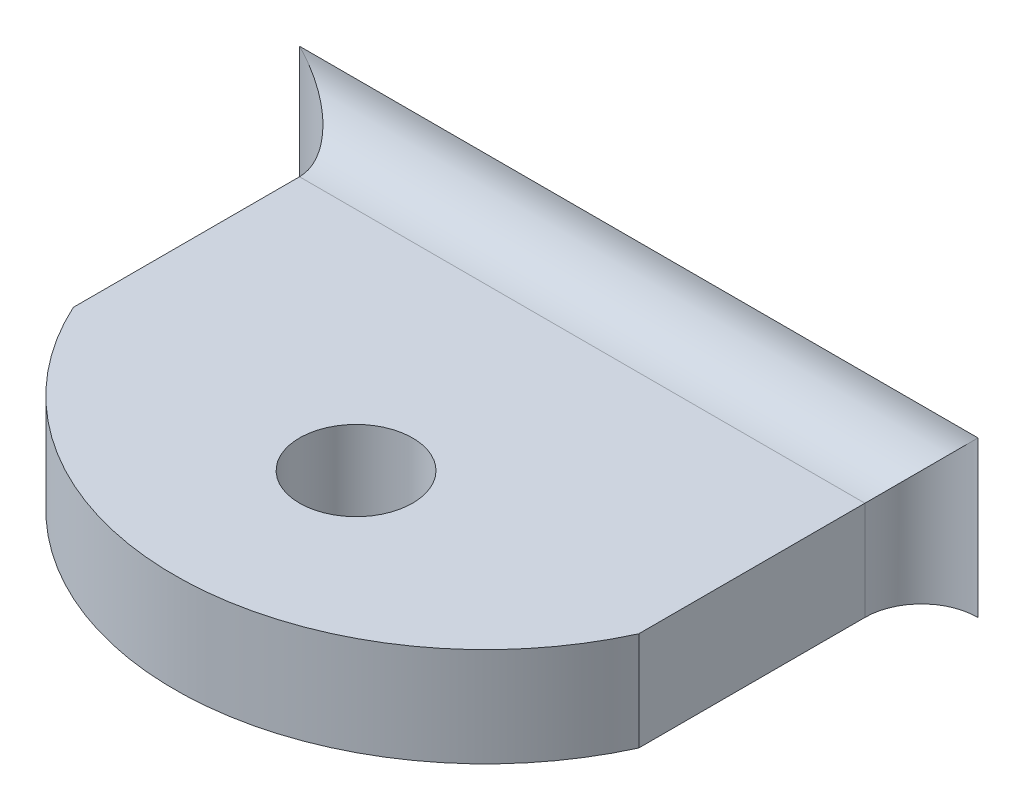
ISO-10303-21;
HEADER;
FILE_DESCRIPTION(('STEP AP214'),'2;1');
FILE_NAME('part.step','',(''),(''),'','','');
FILE_SCHEMA(('AUTOMOTIVE_DESIGN { 1 0 10303 214 1 1 1 1 }'));
ENDSEC;
DATA;
#1=APPLICATION_CONTEXT('core data for automotive mechanical design processes');
#2=APPLICATION_PROTOCOL_DEFINITION('international standard','automotive_design',2000,#1);
#3=PRODUCT_CONTEXT('',#1,'mechanical');
#4=PRODUCT('Part','Part','',(#3));
#5=PRODUCT_RELATED_PRODUCT_CATEGORY('part','',(#4));
#6=PRODUCT_DEFINITION_FORMATION('','',#4);
#7=PRODUCT_DEFINITION_CONTEXT('part definition',#1,'design');
#8=PRODUCT_DEFINITION('design','',#6,#7);
#9=PRODUCT_DEFINITION_SHAPE('','',#8);
#10=(LENGTH_UNIT() NAMED_UNIT(*) SI_UNIT(.MILLI.,.METRE.));
#11=(NAMED_UNIT(*) PLANE_ANGLE_UNIT() SI_UNIT($,.RADIAN.));
#12=(NAMED_UNIT(*) SI_UNIT($,.STERADIAN.) SOLID_ANGLE_UNIT());
#13=UNCERTAINTY_MEASURE_WITH_UNIT(LENGTH_MEASURE(1.E-05),#10,'distance_accuracy_value','');
#14=(GEOMETRIC_REPRESENTATION_CONTEXT(3) GLOBAL_UNCERTAINTY_ASSIGNED_CONTEXT((#13)) GLOBAL_UNIT_ASSIGNED_CONTEXT((#10,
#11,#12)) REPRESENTATION_CONTEXT('',''));
#15=CARTESIAN_POINT('',(0.,0.,0.));
#16=DIRECTION('',(0.,0.,1.));
#17=DIRECTION('',(1.,0.,0.));
#18=AXIS2_PLACEMENT_3D('',#15,#16,#17);
#19=CARTESIAN_POINT('',(0.,23.0322572976377,-98.999691437051));
#20=DIRECTION('',(0.,0.,1.));
#21=DIRECTION('',(1.,0.,0.));
#22=AXIS2_PLACEMENT_3D('',#19,#20,#21);
#23=PLANE('',#22);
#24=DIRECTION('',(0.,-1.,0.));
#25=VECTOR('',#24,1.);
#26=CARTESIAN_POINT('',(-11.9999999999999,-59.1911110560317,-98.999691437051));
#27=LINE('',#26,#25);
#28=CARTESIAN_POINT('',(-11.9999999999999,-1.75,-98.999691437051));
#29=VERTEX_POINT('',#28);
#30=CARTESIAN_POINT('',(-11.9999999999999,3.75,-98.999691437051));
#31=VERTEX_POINT('',#30);
#32=EDGE_CURVE('E134',#29,#31,#27,.F.);
#33=ORIENTED_EDGE('',*,*,#32,.T.);
#34=DIRECTION('',(-1.,0.,0.));
#35=VECTOR('',#34,1.);
#36=CARTESIAN_POINT('',(10.0000000000001,3.75,-98.999691437051));
#37=LINE('',#36,#35);
#38=CARTESIAN_POINT('',(12.0000000000001,3.75,-98.999691437051));
#39=VERTEX_POINT('',#38);
#40=EDGE_CURVE('E46',#31,#39,#37,.F.);
#41=ORIENTED_EDGE('',*,*,#40,.T.);
#42=DIRECTION('',(0.,-1.,0.));
#43=VECTOR('',#42,1.);
#44=CARTESIAN_POINT('',(12.0000000000001,-59.1911110560317,-98.999691437051));
#45=LINE('',#44,#43);
#46=CARTESIAN_POINT('',(12.0000000000001,-1.75,-98.999691437051));
#47=VERTEX_POINT('',#46);
#48=EDGE_CURVE('E61',#39,#47,#45,.T.);
#49=ORIENTED_EDGE('',*,*,#48,.T.);
#50=DIRECTION('',(-1.,0.,0.));
#51=VECTOR('',#50,1.);
#52=CARTESIAN_POINT('',(10.0000000000001,-1.75,-98.999691437051));
#53=LINE('',#52,#51);
#54=EDGE_CURVE('E12',#47,#29,#53,.T.);
#55=ORIENTED_EDGE('',*,*,#54,.T.);
#56=EDGE_LOOP('',(#33,#41,#49,#55));
#57=FACE_BOUND('',#56,.T.);
#58=ADVANCED_FACE('F38',(#57),#23,.F.);
#59=CARTESIAN_POINT('',(0.,1.75,-93.5822671320069));
#60=DIRECTION('',(0.,-1.,0.));
#61=DIRECTION('',(0.,0.,-1.));
#62=AXIS2_PLACEMENT_3D('',#59,#60,#61);
#63=CYLINDRICAL_SURFACE('',#62,11.);
#64=CARTESIAN_POINT('',(0.,-1.75,-93.5822671320069));
#65=DIRECTION('',(0.,1.,0.));
#66=DIRECTION('',(0.,0.,1.));
#67=AXIS2_PLACEMENT_3D('',#64,#65,#66);
#68=CIRCLE('',#67,11.);
#69=CARTESIAN_POINT('',(-9.99999999999994,-1.75,-88.999691437051));
#70=VERTEX_POINT('',#69);
#71=CARTESIAN_POINT('',(10.0000000000001,-1.75,-88.999691437051));
#72=VERTEX_POINT('',#71);
#73=EDGE_CURVE('E124',#70,#72,#68,.T.);
#74=ORIENTED_EDGE('',*,*,#73,.T.);
#75=DIRECTION('',(0.,-1.,0.));
#76=VECTOR('',#75,1.);
#77=CARTESIAN_POINT('',(10.0000000000001,1.75,-88.999691437051));
#78=LINE('',#77,#76);
#79=CARTESIAN_POINT('',(10.0000000000001,1.75,-88.999691437051));
#80=VERTEX_POINT('',#79);
#81=EDGE_CURVE('E113',#80,#72,#78,.T.);
#82=ORIENTED_EDGE('',*,*,#81,.F.);
#83=CARTESIAN_POINT('',(0.,1.75,-93.5822671320069));
#84=DIRECTION('',(0.,1.,0.));
#85=DIRECTION('',(0.,0.,1.));
#86=AXIS2_PLACEMENT_3D('',#83,#84,#85);
#87=CIRCLE('',#86,11.);
#88=CARTESIAN_POINT('',(-9.99999999999994,1.75,-88.999691437051));
#89=VERTEX_POINT('',#88);
#90=EDGE_CURVE('E97',#89,#80,#87,.T.);
#91=ORIENTED_EDGE('',*,*,#90,.F.);
#92=DIRECTION('',(0.,-1.,0.));
#93=VECTOR('',#92,1.);
#94=CARTESIAN_POINT('',(-9.99999999999994,1.75,-88.999691437051));
#95=LINE('',#94,#93);
#96=EDGE_CURVE('E106',#89,#70,#95,.T.);
#97=ORIENTED_EDGE('',*,*,#96,.T.);
#98=EDGE_LOOP('',(#74,#82,#91,#97));
#99=FACE_BOUND('',#98,.T.);
#100=ADVANCED_FACE('F115',(#99),#63,.T.);
#101=CARTESIAN_POINT('',(0.,-59.1911110560317,-89.0000000000001));
#102=DIRECTION('',(0.,1.,0.));
#103=DIRECTION('',(0.,0.,1.));
#104=AXIS2_PLACEMENT_3D('',#101,#102,#103);
#105=CYLINDRICAL_SURFACE('',#104,2.);
#106=CARTESIAN_POINT('',(0.,1.75,-89.0000000000001));
#107=DIRECTION('',(0.,1.,0.));
#108=DIRECTION('',(0.,0.,1.));
#109=AXIS2_PLACEMENT_3D('',#106,#107,#108);
#110=CIRCLE('',#109,2.);
#111=CARTESIAN_POINT('',(0.,1.75,-87.0000000000001));
#112=VERTEX_POINT('',#111);
#113=EDGE_CURVE('E145',#112,#112,#110,.T.);
#114=ORIENTED_EDGE('',*,*,#113,.T.);
#115=EDGE_LOOP('',(#114));
#116=FACE_BOUND('',#115,.T.);
#117=CARTESIAN_POINT('',(0.,-1.75,-89.0000000000001));
#118=DIRECTION('',(0.,1.,0.));
#119=DIRECTION('',(0.,0.,1.));
#120=AXIS2_PLACEMENT_3D('',#117,#118,#119);
#121=CIRCLE('',#120,2.);
#122=CARTESIAN_POINT('',(0.,-1.75,-87.0000000000001));
#123=VERTEX_POINT('',#122);
#124=EDGE_CURVE('E41',#123,#123,#121,.T.);
#125=ORIENTED_EDGE('',*,*,#124,.F.);
#126=EDGE_LOOP('',(#125));
#127=FACE_BOUND('',#126,.T.);
#128=ADVANCED_FACE('F170',(#116,#127),#105,.F.);
#129=CARTESIAN_POINT('',(10.0000000000001,1.75,-88.999691437051));
#130=DIRECTION('',(-1.,0.,0.));
#131=DIRECTION('',(0.,0.,1.));
#132=AXIS2_PLACEMENT_3D('',#129,#130,#131);
#133=PLANE('',#132);
#134=DIRECTION('',(0.,0.,-1.));
#135=VECTOR('',#134,1.);
#136=CARTESIAN_POINT('',(10.0000000000001,-1.75,-88.999691437051));
#137=LINE('',#136,#135);
#138=CARTESIAN_POINT('',(10.0000000000001,-1.75,-96.999691437051));
#139=VERTEX_POINT('',#138);
#140=EDGE_CURVE('E103',#72,#139,#137,.T.);
#141=ORIENTED_EDGE('',*,*,#140,.T.);
#142=DIRECTION('',(0.,-1.,0.));
#143=VECTOR('',#142,1.);
#144=CARTESIAN_POINT('',(10.0000000000001,1.75,-96.999691437051));
#145=LINE('',#144,#143);
#146=CARTESIAN_POINT('',(10.0000000000001,1.75,-96.999691437051));
#147=VERTEX_POINT('',#146);
#148=EDGE_CURVE('E131',#139,#147,#145,.F.);
#149=ORIENTED_EDGE('',*,*,#148,.T.);
#150=DIRECTION('',(0.,0.,-1.));
#151=VECTOR('',#150,1.);
#152=CARTESIAN_POINT('',(10.0000000000001,1.75,-88.999691437051));
#153=LINE('',#152,#151);
#154=EDGE_CURVE('E118',#80,#147,#153,.T.);
#155=ORIENTED_EDGE('',*,*,#154,.F.);
#156=ORIENTED_EDGE('',*,*,#81,.T.);
#157=EDGE_LOOP('',(#141,#149,#155,#156));
#158=FACE_BOUND('',#157,.T.);
#159=ADVANCED_FACE('F150',(#158),#133,.F.);
#160=CARTESIAN_POINT('',(0.,1.75,-93.5822671320069));
#161=DIRECTION('',(0.,1.,0.));
#162=DIRECTION('',(0.,0.,1.));
#163=AXIS2_PLACEMENT_3D('',#160,#161,#162);
#164=PLANE('',#163);
#165=ORIENTED_EDGE('',*,*,#113,.F.);
#166=EDGE_LOOP('',(#165));
#167=FACE_BOUND('',#166,.T.);
#168=ORIENTED_EDGE('',*,*,#154,.T.);
#169=DIRECTION('',(-1.,0.,0.));
#170=VECTOR('',#169,1.);
#171=CARTESIAN_POINT('',(-9.99999999999995,1.75,-96.999691437051));
#172=LINE('',#171,#170);
#173=CARTESIAN_POINT('',(-9.99999999999994,1.75,-96.999691437051));
#174=VERTEX_POINT('',#173);
#175=EDGE_CURVE('E100',#147,#174,#172,.T.);
#176=ORIENTED_EDGE('',*,*,#175,.T.);
#177=DIRECTION('',(0.,0.,1.));
#178=VECTOR('',#177,1.);
#179=CARTESIAN_POINT('',(-9.99999999999995,1.75,-98.999691437051));
#180=LINE('',#179,#178);
#181=EDGE_CURVE('E92',#174,#89,#180,.T.);
#182=ORIENTED_EDGE('',*,*,#181,.T.);
#183=ORIENTED_EDGE('',*,*,#90,.T.);
#184=EDGE_LOOP('',(#168,#176,#182,#183));
#185=FACE_BOUND('',#184,.T.);
#186=ADVANCED_FACE('F95',(#167,#185),#164,.T.);
#187=CARTESIAN_POINT('',(12.0000000000001,-59.1911110560317,-96.999691437051));
#188=DIRECTION('',(0.,-1.,0.));
#189=DIRECTION('',(0.,0.,-1.));
#190=AXIS2_PLACEMENT_3D('',#187,#188,#189);
#191=CYLINDRICAL_SURFACE('',#190,2.);
#192=CARTESIAN_POINT('',(12.0000000000001,-1.75,-96.999691437051));
#193=DIRECTION('',(0.,1.,0.));
#194=DIRECTION('',(0.,0.,1.));
#195=AXIS2_PLACEMENT_3D('',#192,#193,#194);
#196=CIRCLE('',#195,2.);
#197=EDGE_CURVE('E136',#47,#139,#196,.T.);
#198=ORIENTED_EDGE('',*,*,#197,.F.);
#199=ORIENTED_EDGE('',*,*,#48,.F.);
#200=CARTESIAN_POINT('',(12.0000000000001,3.75,-96.999691437051));
#201=DIRECTION('',(0.707106781186547,-0.707106781186547,0.));
#202=DIRECTION('',(0.707106781186547,0.707106781186547,0.));
#203=AXIS2_PLACEMENT_3D('',#200,#201,#202);
#204=ELLIPSE('',#203,2.82842712474619,2.);
#205=EDGE_CURVE('E125',#147,#39,#204,.T.);
#206=ORIENTED_EDGE('',*,*,#205,.F.);
#207=ORIENTED_EDGE('',*,*,#148,.F.);
#208=EDGE_LOOP('',(#198,#199,#206,#207));
#209=FACE_BOUND('',#208,.T.);
#210=ADVANCED_FACE('F148',(#209),#191,.F.);
#211=CARTESIAN_POINT('',(-9.99999999999995,1.75,-98.999691437051));
#212=DIRECTION('',(1.,0.,0.));
#213=DIRECTION('',(0.,0.,-1.));
#214=AXIS2_PLACEMENT_3D('',#211,#212,#213);
#215=PLANE('',#214);
#216=ORIENTED_EDGE('',*,*,#181,.F.);
#217=DIRECTION('',(0.,-1.,0.));
#218=VECTOR('',#217,1.);
#219=CARTESIAN_POINT('',(-9.99999999999994,1.75,-96.999691437051));
#220=LINE('',#219,#218);
#221=CARTESIAN_POINT('',(-9.99999999999994,-1.75,-96.999691437051));
#222=VERTEX_POINT('',#221);
#223=EDGE_CURVE('E112',#174,#222,#220,.T.);
#224=ORIENTED_EDGE('',*,*,#223,.T.);
#225=DIRECTION('',(0.,0.,1.));
#226=VECTOR('',#225,1.);
#227=CARTESIAN_POINT('',(-9.99999999999995,-1.75,-98.999691437051));
#228=LINE('',#227,#226);
#229=EDGE_CURVE('E109',#222,#70,#228,.T.);
#230=ORIENTED_EDGE('',*,*,#229,.T.);
#231=ORIENTED_EDGE('',*,*,#96,.F.);
#232=EDGE_LOOP('',(#216,#224,#230,#231));
#233=FACE_BOUND('',#232,.T.);
#234=ADVANCED_FACE('F107',(#233),#215,.F.);
#235=CARTESIAN_POINT('',(0.,-1.75,-93.5822671320069));
#236=DIRECTION('',(0.,1.,0.));
#237=DIRECTION('',(0.,0.,1.));
#238=AXIS2_PLACEMENT_3D('',#235,#236,#237);
#239=PLANE('',#238);
#240=ORIENTED_EDGE('',*,*,#124,.T.);
#241=EDGE_LOOP('',(#240));
#242=FACE_BOUND('',#241,.T.);
#243=ORIENTED_EDGE('',*,*,#54,.F.);
#244=ORIENTED_EDGE('',*,*,#197,.T.);
#245=ORIENTED_EDGE('',*,*,#140,.F.);
#246=ORIENTED_EDGE('',*,*,#73,.F.);
#247=ORIENTED_EDGE('',*,*,#229,.F.);
#248=CARTESIAN_POINT('',(-11.9999999999999,-1.75,-96.999691437051));
#249=DIRECTION('',(0.,1.,0.));
#250=DIRECTION('',(0.,0.,1.));
#251=AXIS2_PLACEMENT_3D('',#248,#249,#250);
#252=CIRCLE('',#251,2.);
#253=EDGE_CURVE('E139',#222,#29,#252,.T.);
#254=ORIENTED_EDGE('',*,*,#253,.T.);
#255=EDGE_LOOP('',(#243,#244,#245,#246,#247,#254));
#256=FACE_BOUND('',#255,.T.);
#257=ADVANCED_FACE('F153',(#242,#256),#239,.F.);
#258=CARTESIAN_POINT('',(0.,3.75,-96.999691437051));
#259=DIRECTION('',(1.,0.,0.));
#260=DIRECTION('',(0.,0.,-1.));
#261=AXIS2_PLACEMENT_3D('',#258,#259,#260);
#262=CYLINDRICAL_SURFACE('',#261,2.);
#263=ORIENTED_EDGE('',*,*,#205,.T.);
#264=ORIENTED_EDGE('',*,*,#40,.F.);
#265=CARTESIAN_POINT('',(-11.9999999999999,3.75,-96.999691437051));
#266=DIRECTION('',(0.707106781186547,0.707106781186547,0.));
#267=DIRECTION('',(0.707106781186547,-0.707106781186547,0.));
#268=AXIS2_PLACEMENT_3D('',#265,#266,#267);
#269=ELLIPSE('',#268,2.82842712474619,2.);
#270=EDGE_CURVE('E143',#174,#31,#269,.T.);
#271=ORIENTED_EDGE('',*,*,#270,.F.);
#272=ORIENTED_EDGE('',*,*,#175,.F.);
#273=EDGE_LOOP('',(#263,#264,#271,#272));
#274=FACE_BOUND('',#273,.T.);
#275=ADVANCED_FACE('F146',(#274),#262,.F.);
#276=CARTESIAN_POINT('',(-11.9999999999999,1.75,-96.999691437051));
#277=DIRECTION('',(0.,-1.,0.));
#278=DIRECTION('',(0.,0.,-1.));
#279=AXIS2_PLACEMENT_3D('',#276,#277,#278);
#280=CYLINDRICAL_SURFACE('',#279,2.);
#281=ORIENTED_EDGE('',*,*,#270,.T.);
#282=ORIENTED_EDGE('',*,*,#32,.F.);
#283=ORIENTED_EDGE('',*,*,#253,.F.);
#284=ORIENTED_EDGE('',*,*,#223,.F.);
#285=EDGE_LOOP('',(#281,#282,#283,#284));
#286=FACE_BOUND('',#285,.T.);
#287=ADVANCED_FACE('F158',(#286),#280,.F.);
#288=CLOSED_SHELL('',(#58,#100,#128,#159,#186,#210,#234,#257,#275,#287));
#289=MANIFOLD_SOLID_BREP('B2',#288);
#290=ADVANCED_BREP_SHAPE_REPRESENTATION('',(#18,#289),#14);
#291=SHAPE_DEFINITION_REPRESENTATION(#9,#290);
ENDSEC;
END-ISO-10303-21;
